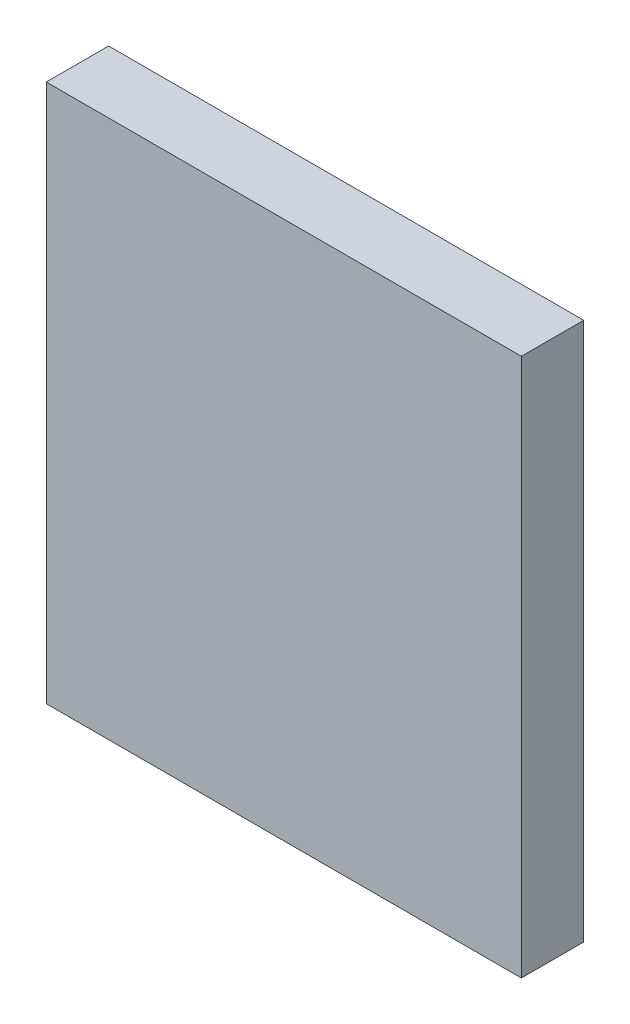
ISO-10303-21;
HEADER;
FILE_DESCRIPTION(('STEP AP214'),'2;1');
FILE_NAME('part.step','',(''),(''),'','','');
FILE_SCHEMA(('AUTOMOTIVE_DESIGN { 1 0 10303 214 1 1 1 1 }'));
ENDSEC;
DATA;
#1=APPLICATION_CONTEXT('core data for automotive mechanical design processes');
#2=APPLICATION_PROTOCOL_DEFINITION('international standard','automotive_design',2000,#1);
#3=PRODUCT_CONTEXT('',#1,'mechanical');
#4=PRODUCT('Part','Part','',(#3));
#5=PRODUCT_RELATED_PRODUCT_CATEGORY('part','',(#4));
#6=PRODUCT_DEFINITION_FORMATION('','',#4);
#7=PRODUCT_DEFINITION_CONTEXT('part definition',#1,'design');
#8=PRODUCT_DEFINITION('design','',#6,#7);
#9=PRODUCT_DEFINITION_SHAPE('','',#8);
#10=(LENGTH_UNIT() NAMED_UNIT(*) SI_UNIT(.MILLI.,.METRE.));
#11=(NAMED_UNIT(*) PLANE_ANGLE_UNIT() SI_UNIT($,.RADIAN.));
#12=(NAMED_UNIT(*) SI_UNIT($,.STERADIAN.) SOLID_ANGLE_UNIT());
#13=UNCERTAINTY_MEASURE_WITH_UNIT(LENGTH_MEASURE(1.E-05),#10,'distance_accuracy_value','');
#14=(GEOMETRIC_REPRESENTATION_CONTEXT(3) GLOBAL_UNCERTAINTY_ASSIGNED_CONTEXT((#13)) GLOBAL_UNIT_ASSIGNED_CONTEXT((#10,
#11,#12)) REPRESENTATION_CONTEXT('',''));
#15=CARTESIAN_POINT('',(0.,0.,0.));
#16=DIRECTION('',(0.,0.,1.));
#17=DIRECTION('',(1.,0.,0.));
#18=AXIS2_PLACEMENT_3D('',#15,#16,#17);
#19=CARTESIAN_POINT('',(-3.81,-4.318,1.));
#20=DIRECTION('',(1.,0.,0.));
#21=DIRECTION('',(0.,0.,-1.));
#22=AXIS2_PLACEMENT_3D('',#19,#20,#21);
#23=PLANE('',#22);
#24=DIRECTION('',(0.,-1.,0.));
#25=VECTOR('',#24,1.);
#26=CARTESIAN_POINT('',(-3.81,-4.318,0.));
#27=LINE('',#26,#25);
#28=CARTESIAN_POINT('',(-3.81,4.318,0.));
#29=VERTEX_POINT('',#28);
#30=CARTESIAN_POINT('',(-3.81,-4.318,0.));
#31=VERTEX_POINT('',#30);
#32=EDGE_CURVE('E95',#29,#31,#27,.T.);
#33=ORIENTED_EDGE('',*,*,#32,.T.);
#34=DIRECTION('',(0.,0.,-1.));
#35=VECTOR('',#34,1.);
#36=CARTESIAN_POINT('',(-3.81,-4.318,1.));
#37=LINE('',#36,#35);
#38=CARTESIAN_POINT('',(-3.81,-4.318,1.));
#39=VERTEX_POINT('',#38);
#40=EDGE_CURVE('E11',#39,#31,#37,.T.);
#41=ORIENTED_EDGE('',*,*,#40,.F.);
#42=DIRECTION('',(0.,-1.,0.));
#43=VECTOR('',#42,1.);
#44=CARTESIAN_POINT('',(-3.81,-4.318,1.));
#45=LINE('',#44,#43);
#46=CARTESIAN_POINT('',(-3.81,4.318,1.));
#47=VERTEX_POINT('',#46);
#48=EDGE_CURVE('E83',#47,#39,#45,.T.);
#49=ORIENTED_EDGE('',*,*,#48,.F.);
#50=DIRECTION('',(0.,0.,-1.));
#51=VECTOR('',#50,1.);
#52=CARTESIAN_POINT('',(-3.81,4.318,1.));
#53=LINE('',#52,#51);
#54=EDGE_CURVE('E91',#47,#29,#53,.T.);
#55=ORIENTED_EDGE('',*,*,#54,.T.);
#56=EDGE_LOOP('',(#33,#41,#49,#55));
#57=FACE_BOUND('',#56,.T.);
#58=ADVANCED_FACE('F32',(#57),#23,.F.);
#59=CARTESIAN_POINT('',(3.81,-4.318,1.));
#60=DIRECTION('',(0.,1.,0.));
#61=DIRECTION('',(0.,0.,1.));
#62=AXIS2_PLACEMENT_3D('',#59,#60,#61);
#63=PLANE('',#62);
#64=DIRECTION('',(1.,0.,0.));
#65=VECTOR('',#64,1.);
#66=CARTESIAN_POINT('',(3.81,-4.318,0.));
#67=LINE('',#66,#65);
#68=CARTESIAN_POINT('',(3.81,-4.318,0.));
#69=VERTEX_POINT('',#68);
#70=EDGE_CURVE('E87',#31,#69,#67,.T.);
#71=ORIENTED_EDGE('',*,*,#70,.T.);
#72=DIRECTION('',(0.,0.,-1.));
#73=VECTOR('',#72,1.);
#74=CARTESIAN_POINT('',(3.81,-4.318,1.));
#75=LINE('',#74,#73);
#76=CARTESIAN_POINT('',(3.81,-4.318,1.));
#77=VERTEX_POINT('',#76);
#78=EDGE_CURVE('E40',#77,#69,#75,.T.);
#79=ORIENTED_EDGE('',*,*,#78,.F.);
#80=DIRECTION('',(1.,0.,0.));
#81=VECTOR('',#80,1.);
#82=CARTESIAN_POINT('',(3.81,-4.318,1.));
#83=LINE('',#82,#81);
#84=EDGE_CURVE('E78',#39,#77,#83,.T.);
#85=ORIENTED_EDGE('',*,*,#84,.F.);
#86=ORIENTED_EDGE('',*,*,#40,.T.);
#87=EDGE_LOOP('',(#71,#79,#85,#86));
#88=FACE_BOUND('',#87,.T.);
#89=ADVANCED_FACE('F86',(#88),#63,.F.);
#90=CARTESIAN_POINT('',(3.81,4.318,1.));
#91=DIRECTION('',(-1.,0.,0.));
#92=DIRECTION('',(0.,0.,1.));
#93=AXIS2_PLACEMENT_3D('',#90,#91,#92);
#94=PLANE('',#93);
#95=DIRECTION('',(0.,1.,0.));
#96=VECTOR('',#95,1.);
#97=CARTESIAN_POINT('',(3.81,4.318,0.));
#98=LINE('',#97,#96);
#99=CARTESIAN_POINT('',(3.81,4.318,0.));
#100=VERTEX_POINT('',#99);
#101=EDGE_CURVE('E65',#69,#100,#98,.T.);
#102=ORIENTED_EDGE('',*,*,#101,.T.);
#103=DIRECTION('',(0.,0.,-1.));
#104=VECTOR('',#103,1.);
#105=CARTESIAN_POINT('',(3.81,4.318,1.));
#106=LINE('',#105,#104);
#107=CARTESIAN_POINT('',(3.81,4.318,1.));
#108=VERTEX_POINT('',#107);
#109=EDGE_CURVE('E88',#108,#100,#106,.T.);
#110=ORIENTED_EDGE('',*,*,#109,.F.);
#111=DIRECTION('',(0.,1.,0.));
#112=VECTOR('',#111,1.);
#113=CARTESIAN_POINT('',(3.81,4.318,1.));
#114=LINE('',#113,#112);
#115=EDGE_CURVE('E81',#77,#108,#114,.T.);
#116=ORIENTED_EDGE('',*,*,#115,.F.);
#117=ORIENTED_EDGE('',*,*,#78,.T.);
#118=EDGE_LOOP('',(#102,#110,#116,#117));
#119=FACE_BOUND('',#118,.T.);
#120=ADVANCED_FACE('F89',(#119),#94,.F.);
#121=CARTESIAN_POINT('',(-3.81,4.318,1.));
#122=DIRECTION('',(0.,-1.,0.));
#123=DIRECTION('',(0.,0.,-1.));
#124=AXIS2_PLACEMENT_3D('',#121,#122,#123);
#125=PLANE('',#124);
#126=DIRECTION('',(-1.,0.,0.));
#127=VECTOR('',#126,1.);
#128=CARTESIAN_POINT('',(-3.81,4.318,0.));
#129=LINE('',#128,#127);
#130=EDGE_CURVE('E71',#100,#29,#129,.T.);
#131=ORIENTED_EDGE('',*,*,#130,.T.);
#132=ORIENTED_EDGE('',*,*,#54,.F.);
#133=DIRECTION('',(-1.,0.,0.));
#134=VECTOR('',#133,1.);
#135=CARTESIAN_POINT('',(-3.81,4.318,1.));
#136=LINE('',#135,#134);
#137=EDGE_CURVE('E48',#108,#47,#136,.T.);
#138=ORIENTED_EDGE('',*,*,#137,.F.);
#139=ORIENTED_EDGE('',*,*,#109,.T.);
#140=EDGE_LOOP('',(#131,#132,#138,#139));
#141=FACE_BOUND('',#140,.T.);
#142=ADVANCED_FACE('F102',(#141),#125,.F.);
#143=CARTESIAN_POINT('',(0.,0.,1.));
#144=DIRECTION('',(0.,0.,-1.));
#145=DIRECTION('',(-1.,0.,0.));
#146=AXIS2_PLACEMENT_3D('',#143,#144,#145);
#147=PLANE('',#146);
#148=ORIENTED_EDGE('',*,*,#48,.T.);
#149=ORIENTED_EDGE('',*,*,#84,.T.);
#150=ORIENTED_EDGE('',*,*,#115,.T.);
#151=ORIENTED_EDGE('',*,*,#137,.T.);
#152=EDGE_LOOP('',(#148,#149,#150,#151));
#153=FACE_BOUND('',#152,.T.);
#154=ADVANCED_FACE('F79',(#153),#147,.F.);
#155=CARTESIAN_POINT('',(0.,0.,0.));
#156=DIRECTION('',(0.,0.,-1.));
#157=DIRECTION('',(-1.,0.,0.));
#158=AXIS2_PLACEMENT_3D('',#155,#156,#157);
#159=PLANE('',#158);
#160=ORIENTED_EDGE('',*,*,#32,.F.);
#161=ORIENTED_EDGE('',*,*,#130,.F.);
#162=ORIENTED_EDGE('',*,*,#101,.F.);
#163=ORIENTED_EDGE('',*,*,#70,.F.);
#164=EDGE_LOOP('',(#160,#161,#162,#163));
#165=FACE_BOUND('',#164,.T.);
#166=ADVANCED_FACE('F105',(#165),#159,.T.);
#167=CLOSED_SHELL('',(#58,#89,#120,#142,#154,#166));
#168=MANIFOLD_SOLID_BREP('B2',#167);
#169=ADVANCED_BREP_SHAPE_REPRESENTATION('',(#18,#168),#14);
#170=SHAPE_DEFINITION_REPRESENTATION(#9,#169);
ENDSEC;
END-ISO-10303-21;
